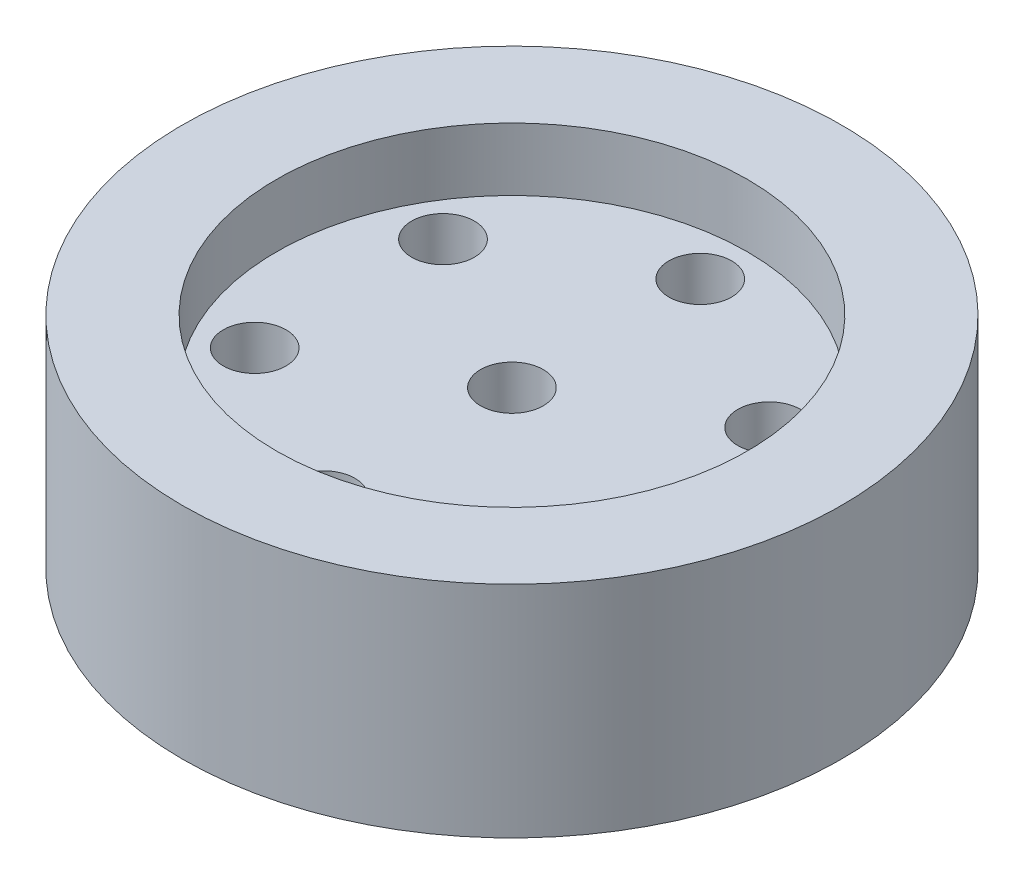
ISO-10303-21;
HEADER;
FILE_DESCRIPTION(('STEP AP214'),'2;1');
FILE_NAME('part.step','',(''),(''),'','','');
FILE_SCHEMA(('AUTOMOTIVE_DESIGN { 1 0 10303 214 1 1 1 1 }'));
ENDSEC;
DATA;
#1=APPLICATION_CONTEXT('core data for automotive mechanical design processes');
#2=APPLICATION_PROTOCOL_DEFINITION('international standard','automotive_design',2000,#1);
#3=PRODUCT_CONTEXT('',#1,'mechanical');
#4=PRODUCT('Part','Part','',(#3));
#5=PRODUCT_RELATED_PRODUCT_CATEGORY('part','',(#4));
#6=PRODUCT_DEFINITION_FORMATION('','',#4);
#7=PRODUCT_DEFINITION_CONTEXT('part definition',#1,'design');
#8=PRODUCT_DEFINITION('design','',#6,#7);
#9=PRODUCT_DEFINITION_SHAPE('','',#8);
#10=(LENGTH_UNIT() NAMED_UNIT(*) SI_UNIT(.MILLI.,.METRE.));
#11=(NAMED_UNIT(*) PLANE_ANGLE_UNIT() SI_UNIT($,.RADIAN.));
#12=(NAMED_UNIT(*) SI_UNIT($,.STERADIAN.) SOLID_ANGLE_UNIT());
#13=UNCERTAINTY_MEASURE_WITH_UNIT(LENGTH_MEASURE(1.E-05),#10,'distance_accuracy_value','');
#14=(GEOMETRIC_REPRESENTATION_CONTEXT(3) GLOBAL_UNCERTAINTY_ASSIGNED_CONTEXT((#13)) GLOBAL_UNIT_ASSIGNED_CONTEXT((#10,
#11,#12)) REPRESENTATION_CONTEXT('',''));
#15=CARTESIAN_POINT('',(0.,0.,0.));
#16=DIRECTION('',(0.,0.,1.));
#17=DIRECTION('',(1.,0.,0.));
#18=AXIS2_PLACEMENT_3D('',#15,#16,#17);
#19=CARTESIAN_POINT('',(0.,14.,0.));
#20=DIRECTION('',(0.,-1.,0.));
#21=DIRECTION('',(0.,0.,-1.));
#22=AXIS2_PLACEMENT_3D('',#19,#20,#21);
#23=CYLINDRICAL_SURFACE('',#22,21.);
#24=CARTESIAN_POINT('',(0.,14.,0.));
#25=DIRECTION('',(0.,1.,0.));
#26=DIRECTION('',(0.,0.,1.));
#27=AXIS2_PLACEMENT_3D('',#24,#25,#26);
#28=CIRCLE('',#27,21.);
#29=CARTESIAN_POINT('',(0.,14.,21.));
#30=VERTEX_POINT('',#29);
#31=EDGE_CURVE('E10',#30,#30,#28,.T.);
#32=ORIENTED_EDGE('',*,*,#31,.F.);
#33=EDGE_LOOP('',(#32));
#34=FACE_BOUND('',#33,.T.);
#35=CARTESIAN_POINT('',(0.,0.,0.));
#36=DIRECTION('',(0.,1.,0.));
#37=DIRECTION('',(0.,0.,1.));
#38=AXIS2_PLACEMENT_3D('',#35,#36,#37);
#39=CIRCLE('',#38,21.);
#40=CARTESIAN_POINT('',(0.,0.,21.));
#41=VERTEX_POINT('',#40);
#42=EDGE_CURVE('E40',#41,#41,#39,.T.);
#43=ORIENTED_EDGE('',*,*,#42,.T.);
#44=EDGE_LOOP('',(#43));
#45=FACE_BOUND('',#44,.T.);
#46=ADVANCED_FACE('F37',(#34,#45),#23,.T.);
#47=CARTESIAN_POINT('',(0.,14.,0.));
#48=DIRECTION('',(0.,1.,0.));
#49=DIRECTION('',(0.,0.,1.));
#50=AXIS2_PLACEMENT_3D('',#47,#48,#49);
#51=PLANE('',#50);
#52=CARTESIAN_POINT('',(0.,14.,0.));
#53=DIRECTION('',(0.,1.,0.));
#54=DIRECTION('',(0.,0.,1.));
#55=AXIS2_PLACEMENT_3D('',#52,#53,#54);
#56=CIRCLE('',#55,15.);
#57=CARTESIAN_POINT('',(0.,14.,15.));
#58=VERTEX_POINT('',#57);
#59=EDGE_CURVE('E51',#58,#58,#56,.T.);
#60=ORIENTED_EDGE('',*,*,#59,.F.);
#61=EDGE_LOOP('',(#60));
#62=FACE_BOUND('',#61,.T.);
#63=ORIENTED_EDGE('',*,*,#31,.T.);
#64=EDGE_LOOP('',(#63));
#65=FACE_BOUND('',#64,.T.);
#66=ADVANCED_FACE('F163',(#62,#65),#51,.T.);
#67=CARTESIAN_POINT('',(0.,0.,0.));
#68=DIRECTION('',(0.,1.,0.));
#69=DIRECTION('',(0.,0.,1.));
#70=AXIS2_PLACEMENT_3D('',#67,#68,#69);
#71=PLANE('',#70);
#72=CARTESIAN_POINT('',(0.,0.,0.));
#73=DIRECTION('',(0.,-1.,0.));
#74=DIRECTION('',(0.,0.,-1.));
#75=AXIS2_PLACEMENT_3D('',#72,#73,#74);
#76=CIRCLE('',#75,19.);
#77=CARTESIAN_POINT('',(0.,0.,-19.));
#78=VERTEX_POINT('',#77);
#79=EDGE_CURVE('E59',#78,#78,#76,.T.);
#80=ORIENTED_EDGE('',*,*,#79,.F.);
#81=EDGE_LOOP('',(#80));
#82=FACE_BOUND('',#81,.T.);
#83=ORIENTED_EDGE('',*,*,#42,.F.);
#84=EDGE_LOOP('',(#83));
#85=FACE_BOUND('',#84,.T.);
#86=ADVANCED_FACE('F159',(#82,#85),#71,.F.);
#87=CARTESIAN_POINT('',(0.,10.,0.));
#88=DIRECTION('',(0.,1.,0.));
#89=DIRECTION('',(0.,0.,1.));
#90=AXIS2_PLACEMENT_3D('',#87,#88,#89);
#91=CYLINDRICAL_SURFACE('',#90,15.);
#92=CARTESIAN_POINT('',(0.,10.,0.));
#93=DIRECTION('',(0.,1.,0.));
#94=DIRECTION('',(0.,0.,1.));
#95=AXIS2_PLACEMENT_3D('',#92,#93,#94);
#96=CIRCLE('',#95,15.);
#97=CARTESIAN_POINT('',(0.,10.,15.));
#98=VERTEX_POINT('',#97);
#99=EDGE_CURVE('E49',#98,#98,#96,.T.);
#100=ORIENTED_EDGE('',*,*,#99,.F.);
#101=EDGE_LOOP('',(#100));
#102=FACE_BOUND('',#101,.T.);
#103=ORIENTED_EDGE('',*,*,#59,.T.);
#104=EDGE_LOOP('',(#103));
#105=FACE_BOUND('',#104,.T.);
#106=ADVANCED_FACE('F162',(#102,#105),#91,.F.);
#107=CARTESIAN_POINT('',(0.,10.,0.));
#108=DIRECTION('',(0.,1.,0.));
#109=DIRECTION('',(0.,0.,1.));
#110=AXIS2_PLACEMENT_3D('',#107,#108,#109);
#111=PLANE('',#110);
#112=CARTESIAN_POINT('',(0.,10.,12.));
#113=DIRECTION('',(0.,1.,0.));
#114=DIRECTION('',(0.,0.,1.));
#115=AXIS2_PLACEMENT_3D('',#112,#113,#114);
#116=CIRCLE('',#115,2.);
#117=CARTESIAN_POINT('',(0.,10.,14.));
#118=VERTEX_POINT('',#117);
#119=EDGE_CURVE('E82',#118,#118,#116,.T.);
#120=ORIENTED_EDGE('',*,*,#119,.F.);
#121=EDGE_LOOP('',(#120));
#122=FACE_BOUND('',#121,.T.);
#123=CARTESIAN_POINT('',(-10.3923048454129,10.,5.9999999999994));
#124=DIRECTION('',(0.,1.,0.));
#125=DIRECTION('',(0.,0.,1.));
#126=AXIS2_PLACEMENT_3D('',#123,#124,#125);
#127=CIRCLE('',#126,2.00000000000064);
#128=CARTESIAN_POINT('',(-10.3923048454129,10.,8.00000000000004));
#129=VERTEX_POINT('',#128);
#130=EDGE_CURVE('E86',#129,#129,#127,.T.);
#131=ORIENTED_EDGE('',*,*,#130,.F.);
#132=EDGE_LOOP('',(#131));
#133=FACE_BOUND('',#132,.T.);
#134=CARTESIAN_POINT('',(-10.3923048454122,10.,-6.00000000000059));
#135=DIRECTION('',(0.,1.,0.));
#136=DIRECTION('',(0.,0.,1.));
#137=AXIS2_PLACEMENT_3D('',#134,#135,#136);
#138=CIRCLE('',#137,2.00000000000126);
#139=CARTESIAN_POINT('',(-10.3923048454122,10.,-3.99999999999934));
#140=VERTEX_POINT('',#139);
#141=EDGE_CURVE('E90',#140,#140,#138,.T.);
#142=ORIENTED_EDGE('',*,*,#141,.F.);
#143=EDGE_LOOP('',(#142));
#144=FACE_BOUND('',#143,.T.);
#145=CARTESIAN_POINT('',(1.35983332418246E-12,10.,-12.));
#146=DIRECTION('',(0.,1.,0.));
#147=DIRECTION('',(0.,0.,1.));
#148=AXIS2_PLACEMENT_3D('',#145,#146,#147);
#149=CIRCLE('',#148,2.00000000000138);
#150=CARTESIAN_POINT('',(1.35983332418246E-12,10.,-9.99999999999862));
#151=VERTEX_POINT('',#150);
#152=EDGE_CURVE('E94',#151,#151,#149,.T.);
#153=ORIENTED_EDGE('',*,*,#152,.F.);
#154=EDGE_LOOP('',(#153));
#155=FACE_BOUND('',#154,.T.);
#156=CARTESIAN_POINT('',(10.3923048454143,10.,-5.99999999999941));
#157=DIRECTION('',(0.,1.,0.));
#158=DIRECTION('',(0.,0.,1.));
#159=AXIS2_PLACEMENT_3D('',#156,#157,#158);
#160=CIRCLE('',#159,2.00000000000086);
#161=CARTESIAN_POINT('',(10.3923048454143,10.,-3.99999999999855));
#162=VERTEX_POINT('',#161);
#163=EDGE_CURVE('E98',#162,#162,#160,.T.);
#164=ORIENTED_EDGE('',*,*,#163,.F.);
#165=EDGE_LOOP('',(#164));
#166=FACE_BOUND('',#165,.T.);
#167=CARTESIAN_POINT('',(10.3923048454136,10.,6.00000000000059));
#168=DIRECTION('',(0.,1.,0.));
#169=DIRECTION('',(0.,0.,1.));
#170=AXIS2_PLACEMENT_3D('',#167,#168,#169);
#171=CIRCLE('',#170,2.00000000000019);
#172=CARTESIAN_POINT('',(10.3923048454136,10.,8.00000000000078));
#173=VERTEX_POINT('',#172);
#174=EDGE_CURVE('E102',#173,#173,#171,.T.);
#175=ORIENTED_EDGE('',*,*,#174,.F.);
#176=EDGE_LOOP('',(#175));
#177=FACE_BOUND('',#176,.T.);
#178=CARTESIAN_POINT('',(0.,10.,0.));
#179=DIRECTION('',(0.,1.,0.));
#180=DIRECTION('',(0.,0.,1.));
#181=AXIS2_PLACEMENT_3D('',#178,#179,#180);
#182=CIRCLE('',#181,2.);
#183=CARTESIAN_POINT('',(0.,10.,2.));
#184=VERTEX_POINT('',#183);
#185=EDGE_CURVE('E71',#184,#184,#182,.T.);
#186=ORIENTED_EDGE('',*,*,#185,.F.);
#187=EDGE_LOOP('',(#186));
#188=FACE_BOUND('',#187,.T.);
#189=ORIENTED_EDGE('',*,*,#99,.T.);
#190=EDGE_LOOP('',(#189));
#191=FACE_BOUND('',#190,.T.);
#192=ADVANCED_FACE('F155',(#122,#133,#144,#155,#166,#177,#188,#191),#111,.T.);
#193=CARTESIAN_POINT('',(0.,4.,0.));
#194=DIRECTION('',(0.,-1.,0.));
#195=DIRECTION('',(0.,0.,-1.));
#196=AXIS2_PLACEMENT_3D('',#193,#194,#195);
#197=CYLINDRICAL_SURFACE('',#196,19.);
#198=CARTESIAN_POINT('',(0.,4.,0.));
#199=DIRECTION('',(0.,-1.,0.));
#200=DIRECTION('',(0.,0.,-1.));
#201=AXIS2_PLACEMENT_3D('',#198,#199,#200);
#202=CIRCLE('',#201,19.);
#203=CARTESIAN_POINT('',(0.,4.,-19.));
#204=VERTEX_POINT('',#203);
#205=EDGE_CURVE('E55',#204,#204,#202,.T.);
#206=ORIENTED_EDGE('',*,*,#205,.F.);
#207=EDGE_LOOP('',(#206));
#208=FACE_BOUND('',#207,.T.);
#209=ORIENTED_EDGE('',*,*,#79,.T.);
#210=EDGE_LOOP('',(#209));
#211=FACE_BOUND('',#210,.T.);
#212=ADVANCED_FACE('F137',(#208,#211),#197,.F.);
#213=CARTESIAN_POINT('',(0.,4.,0.));
#214=DIRECTION('',(0.,-1.,0.));
#215=DIRECTION('',(0.,0.,-1.));
#216=AXIS2_PLACEMENT_3D('',#213,#214,#215);
#217=PLANE('',#216);
#218=CARTESIAN_POINT('',(0.,4.,12.));
#219=DIRECTION('',(0.,-1.,0.));
#220=DIRECTION('',(0.,0.,-1.));
#221=AXIS2_PLACEMENT_3D('',#218,#219,#220);
#222=CIRCLE('',#221,2.);
#223=CARTESIAN_POINT('',(0.,4.,10.));
#224=VERTEX_POINT('',#223);
#225=EDGE_CURVE('E106',#224,#224,#222,.T.);
#226=ORIENTED_EDGE('',*,*,#225,.F.);
#227=EDGE_LOOP('',(#226));
#228=FACE_BOUND('',#227,.T.);
#229=CARTESIAN_POINT('',(-10.3923048454129,4.,5.9999999999994));
#230=DIRECTION('',(0.,-1.,0.));
#231=DIRECTION('',(0.,0.,-1.));
#232=AXIS2_PLACEMENT_3D('',#229,#230,#231);
#233=CIRCLE('',#232,2.00000000000064);
#234=CARTESIAN_POINT('',(-10.3923048454129,4.,3.99999999999876));
#235=VERTEX_POINT('',#234);
#236=EDGE_CURVE('E112',#235,#235,#233,.T.);
#237=ORIENTED_EDGE('',*,*,#236,.F.);
#238=EDGE_LOOP('',(#237));
#239=FACE_BOUND('',#238,.T.);
#240=CARTESIAN_POINT('',(-10.3923048454122,4.,-6.00000000000059));
#241=DIRECTION('',(0.,-1.,0.));
#242=DIRECTION('',(0.,0.,-1.));
#243=AXIS2_PLACEMENT_3D('',#240,#241,#242);
#244=CIRCLE('',#243,2.00000000000126);
#245=CARTESIAN_POINT('',(-10.3923048454122,4.,-8.00000000000185));
#246=VERTEX_POINT('',#245);
#247=EDGE_CURVE('E107',#246,#246,#244,.T.);
#248=ORIENTED_EDGE('',*,*,#247,.F.);
#249=EDGE_LOOP('',(#248));
#250=FACE_BOUND('',#249,.T.);
#251=CARTESIAN_POINT('',(1.35983332418246E-12,4.,-12.));
#252=DIRECTION('',(0.,-1.,0.));
#253=DIRECTION('',(0.,0.,-1.));
#254=AXIS2_PLACEMENT_3D('',#251,#252,#253);
#255=CIRCLE('',#254,2.00000000000138);
#256=CARTESIAN_POINT('',(1.35983332418246E-12,4.,-14.0000000000014));
#257=VERTEX_POINT('',#256);
#258=EDGE_CURVE('E111',#257,#257,#255,.T.);
#259=ORIENTED_EDGE('',*,*,#258,.F.);
#260=EDGE_LOOP('',(#259));
#261=FACE_BOUND('',#260,.T.);
#262=CARTESIAN_POINT('',(10.3923048454143,4.,-5.99999999999941));
#263=DIRECTION('',(0.,-1.,0.));
#264=DIRECTION('',(0.,0.,-1.));
#265=AXIS2_PLACEMENT_3D('',#262,#263,#264);
#266=CIRCLE('',#265,2.00000000000086);
#267=CARTESIAN_POINT('',(10.3923048454143,4.,-8.00000000000027));
#268=VERTEX_POINT('',#267);
#269=EDGE_CURVE('E116',#268,#268,#266,.T.);
#270=ORIENTED_EDGE('',*,*,#269,.F.);
#271=EDGE_LOOP('',(#270));
#272=FACE_BOUND('',#271,.T.);
#273=CARTESIAN_POINT('',(10.3923048454136,4.,6.00000000000059));
#274=DIRECTION('',(0.,-1.,0.));
#275=DIRECTION('',(0.,0.,-1.));
#276=AXIS2_PLACEMENT_3D('',#273,#274,#275);
#277=CIRCLE('',#276,2.00000000000019);
#278=CARTESIAN_POINT('',(10.3923048454136,4.,4.00000000000041));
#279=VERTEX_POINT('',#278);
#280=EDGE_CURVE('E120',#279,#279,#277,.T.);
#281=ORIENTED_EDGE('',*,*,#280,.F.);
#282=EDGE_LOOP('',(#281));
#283=FACE_BOUND('',#282,.T.);
#284=CARTESIAN_POINT('',(0.,4.,0.));
#285=DIRECTION('',(0.,-1.,0.));
#286=DIRECTION('',(0.,0.,-1.));
#287=AXIS2_PLACEMENT_3D('',#284,#285,#286);
#288=CIRCLE('',#287,5.);
#289=CARTESIAN_POINT('',(0.,4.,-5.));
#290=VERTEX_POINT('',#289);
#291=EDGE_CURVE('E63',#290,#290,#288,.T.);
#292=ORIENTED_EDGE('',*,*,#291,.F.);
#293=EDGE_LOOP('',(#292));
#294=FACE_BOUND('',#293,.T.);
#295=ORIENTED_EDGE('',*,*,#205,.T.);
#296=EDGE_LOOP('',(#295));
#297=FACE_BOUND('',#296,.T.);
#298=ADVANCED_FACE('F133',(#228,#239,#250,#261,#272,#283,#294,#297),#217,.T.);
#299=CARTESIAN_POINT('',(0.,4.,0.));
#300=DIRECTION('',(0.,-1.,0.));
#301=DIRECTION('',(0.,0.,-1.));
#302=AXIS2_PLACEMENT_3D('',#299,#300,#301);
#303=CYLINDRICAL_SURFACE('',#302,5.);
#304=ORIENTED_EDGE('',*,*,#291,.T.);
#305=EDGE_LOOP('',(#304));
#306=FACE_BOUND('',#305,.T.);
#307=CARTESIAN_POINT('',(0.,0.,0.));
#308=DIRECTION('',(0.,-1.,0.));
#309=DIRECTION('',(0.,0.,-1.));
#310=AXIS2_PLACEMENT_3D('',#307,#308,#309);
#311=CIRCLE('',#310,5.);
#312=CARTESIAN_POINT('',(0.,0.,-5.));
#313=VERTEX_POINT('',#312);
#314=EDGE_CURVE('E67',#313,#313,#311,.T.);
#315=ORIENTED_EDGE('',*,*,#314,.F.);
#316=EDGE_LOOP('',(#315));
#317=FACE_BOUND('',#316,.T.);
#318=ADVANCED_FACE('F136',(#306,#317),#303,.T.);
#319=CARTESIAN_POINT('',(0.,0.,0.));
#320=DIRECTION('',(0.,-1.,0.));
#321=DIRECTION('',(0.,0.,-1.));
#322=AXIS2_PLACEMENT_3D('',#319,#320,#321);
#323=CIRCLE('',#322,2.);
#324=CARTESIAN_POINT('',(0.,0.,-2.));
#325=VERTEX_POINT('',#324);
#326=EDGE_CURVE('E78',#325,#325,#323,.T.);
#327=ORIENTED_EDGE('',*,*,#326,.F.);
#328=EDGE_LOOP('',(#327));
#329=FACE_BOUND('',#328,.T.);
#330=ORIENTED_EDGE('',*,*,#314,.T.);
#331=EDGE_LOOP('',(#330));
#332=FACE_BOUND('',#331,.T.);
#333=ADVANCED_FACE('F164',(#329,#332),#71,.F.);
#334=CARTESIAN_POINT('',(0.,14.,0.));
#335=DIRECTION('',(0.,-1.,0.));
#336=DIRECTION('',(0.,0.,-1.));
#337=AXIS2_PLACEMENT_3D('',#334,#335,#336);
#338=CYLINDRICAL_SURFACE('',#337,2.);
#339=ORIENTED_EDGE('',*,*,#185,.T.);
#340=EDGE_LOOP('',(#339));
#341=FACE_BOUND('',#340,.T.);
#342=ORIENTED_EDGE('',*,*,#326,.T.);
#343=EDGE_LOOP('',(#342));
#344=FACE_BOUND('',#343,.T.);
#345=ADVANCED_FACE('F187',(#341,#344),#338,.F.);
#346=CARTESIAN_POINT('',(10.3923048454136,14.,6.00000000000059));
#347=DIRECTION('',(0.,-1.,0.));
#348=DIRECTION('',(0.,0.,-1.));
#349=AXIS2_PLACEMENT_3D('',#346,#347,#348);
#350=CYLINDRICAL_SURFACE('',#349,2.00000000000019);
#351=ORIENTED_EDGE('',*,*,#174,.T.);
#352=EDGE_LOOP('',(#351));
#353=FACE_BOUND('',#352,.T.);
#354=ORIENTED_EDGE('',*,*,#280,.T.);
#355=EDGE_LOOP('',(#354));
#356=FACE_BOUND('',#355,.T.);
#357=ADVANCED_FACE('F190',(#353,#356),#350,.F.);
#358=CARTESIAN_POINT('',(10.3923048454143,14.,-5.99999999999941));
#359=DIRECTION('',(0.,-1.,0.));
#360=DIRECTION('',(0.,0.,-1.));
#361=AXIS2_PLACEMENT_3D('',#358,#359,#360);
#362=CYLINDRICAL_SURFACE('',#361,2.00000000000086);
#363=ORIENTED_EDGE('',*,*,#163,.T.);
#364=EDGE_LOOP('',(#363));
#365=FACE_BOUND('',#364,.T.);
#366=ORIENTED_EDGE('',*,*,#269,.T.);
#367=EDGE_LOOP('',(#366));
#368=FACE_BOUND('',#367,.T.);
#369=ADVANCED_FACE('F200',(#365,#368),#362,.F.);
#370=CARTESIAN_POINT('',(1.35983332418246E-12,14.,-12.));
#371=DIRECTION('',(0.,-1.,0.));
#372=DIRECTION('',(0.,0.,-1.));
#373=AXIS2_PLACEMENT_3D('',#370,#371,#372);
#374=CYLINDRICAL_SURFACE('',#373,2.00000000000138);
#375=ORIENTED_EDGE('',*,*,#152,.T.);
#376=EDGE_LOOP('',(#375));
#377=FACE_BOUND('',#376,.T.);
#378=ORIENTED_EDGE('',*,*,#258,.T.);
#379=EDGE_LOOP('',(#378));
#380=FACE_BOUND('',#379,.T.);
#381=ADVANCED_FACE('F196',(#377,#380),#374,.F.);
#382=CARTESIAN_POINT('',(-10.3923048454122,14.,-6.00000000000059));
#383=DIRECTION('',(0.,-1.,0.));
#384=DIRECTION('',(0.,0.,-1.));
#385=AXIS2_PLACEMENT_3D('',#382,#383,#384);
#386=CYLINDRICAL_SURFACE('',#385,2.00000000000126);
#387=ORIENTED_EDGE('',*,*,#141,.T.);
#388=EDGE_LOOP('',(#387));
#389=FACE_BOUND('',#388,.T.);
#390=ORIENTED_EDGE('',*,*,#247,.T.);
#391=EDGE_LOOP('',(#390));
#392=FACE_BOUND('',#391,.T.);
#393=ADVANCED_FACE('F192',(#389,#392),#386,.F.);
#394=CARTESIAN_POINT('',(-10.3923048454129,14.,5.9999999999994));
#395=DIRECTION('',(0.,-1.,0.));
#396=DIRECTION('',(0.,0.,-1.));
#397=AXIS2_PLACEMENT_3D('',#394,#395,#396);
#398=CYLINDRICAL_SURFACE('',#397,2.00000000000064);
#399=ORIENTED_EDGE('',*,*,#130,.T.);
#400=EDGE_LOOP('',(#399));
#401=FACE_BOUND('',#400,.T.);
#402=ORIENTED_EDGE('',*,*,#236,.T.);
#403=EDGE_LOOP('',(#402));
#404=FACE_BOUND('',#403,.T.);
#405=ADVANCED_FACE('F195',(#401,#404),#398,.F.);
#406=CARTESIAN_POINT('',(0.,14.,12.));
#407=DIRECTION('',(0.,-1.,0.));
#408=DIRECTION('',(0.,0.,-1.));
#409=AXIS2_PLACEMENT_3D('',#406,#407,#408);
#410=CYLINDRICAL_SURFACE('',#409,2.);
#411=ORIENTED_EDGE('',*,*,#119,.T.);
#412=EDGE_LOOP('',(#411));
#413=FACE_BOUND('',#412,.T.);
#414=ORIENTED_EDGE('',*,*,#225,.T.);
#415=EDGE_LOOP('',(#414));
#416=FACE_BOUND('',#415,.T.);
#417=ADVANCED_FACE('F131',(#413,#416),#410,.F.);
#418=CLOSED_SHELL('',(#46,#66,#86,#106,#192,#212,#298,#318,#333,#345,#357,#369,#381,#393,#405,#417));
#419=MANIFOLD_SOLID_BREP('B2',#418);
#420=ADVANCED_BREP_SHAPE_REPRESENTATION('',(#18,#419),#14);
#421=SHAPE_DEFINITION_REPRESENTATION(#9,#420);
ENDSEC;
END-ISO-10303-21;
